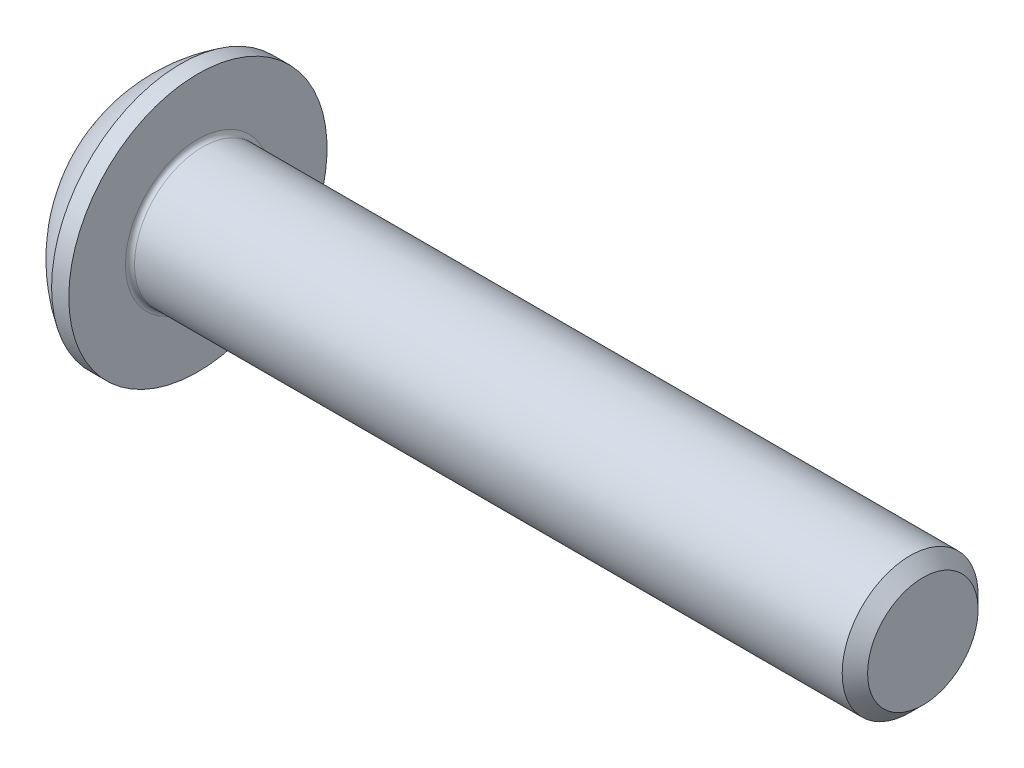
ISO-10303-21;
HEADER;
FILE_DESCRIPTION(('STEP AP214'),'2;1');
FILE_NAME('part.step','',(''),(''),'','','');
FILE_SCHEMA(('AUTOMOTIVE_DESIGN { 1 0 10303 214 1 1 1 1 }'));
ENDSEC;
DATA;
#1=APPLICATION_CONTEXT('core data for automotive mechanical design processes');
#2=APPLICATION_PROTOCOL_DEFINITION('international standard','automotive_design',2000,#1);
#3=PRODUCT_CONTEXT('',#1,'mechanical');
#4=PRODUCT('Part','Part','',(#3));
#5=PRODUCT_RELATED_PRODUCT_CATEGORY('part','',(#4));
#6=PRODUCT_DEFINITION_FORMATION('','',#4);
#7=PRODUCT_DEFINITION_CONTEXT('part definition',#1,'design');
#8=PRODUCT_DEFINITION('design','',#6,#7);
#9=PRODUCT_DEFINITION_SHAPE('','',#8);
#10=(LENGTH_UNIT() NAMED_UNIT(*) SI_UNIT(.MILLI.,.METRE.));
#11=(NAMED_UNIT(*) PLANE_ANGLE_UNIT() SI_UNIT($,.RADIAN.));
#12=(NAMED_UNIT(*) SI_UNIT($,.STERADIAN.) SOLID_ANGLE_UNIT());
#13=UNCERTAINTY_MEASURE_WITH_UNIT(LENGTH_MEASURE(1.E-05),#10,'distance_accuracy_value','');
#14=(GEOMETRIC_REPRESENTATION_CONTEXT(3) GLOBAL_UNCERTAINTY_ASSIGNED_CONTEXT((#13)) GLOBAL_UNIT_ASSIGNED_CONTEXT((#10,
#11,#12)) REPRESENTATION_CONTEXT('',''));
#15=CARTESIAN_POINT('',(0.,0.,0.));
#16=DIRECTION('',(0.,0.,1.));
#17=DIRECTION('',(1.,0.,0.));
#18=AXIS2_PLACEMENT_3D('',#15,#16,#17);
#19=CARTESIAN_POINT('',(0.,0.,0.));
#20=DIRECTION('',(-1.,0.,0.));
#21=DIRECTION('',(0.,0.,1.));
#22=AXIS2_PLACEMENT_3D('',#19,#20,#21);
#23=PLANE('',#22);
#24=CARTESIAN_POINT('',(0.,0.,0.));
#25=DIRECTION('',(-1.,0.,0.));
#26=DIRECTION('',(0.,0.,1.));
#27=AXIS2_PLACEMENT_3D('',#24,#25,#26);
#28=CIRCLE('',#27,1.425);
#29=CARTESIAN_POINT('',(0.,0.,1.425));
#30=VERTEX_POINT('',#29);
#31=EDGE_CURVE('E155',#30,#30,#28,.T.);
#32=ORIENTED_EDGE('',*,*,#31,.T.);
#33=EDGE_LOOP('',(#32));
#34=FACE_BOUND('',#33,.T.);
#35=DIRECTION('',(0.,-1.,0.));
#36=VECTOR('',#35,1.);
#37=CARTESIAN_POINT('',(0.,-0.577350269189625,0.999999999999998));
#38=LINE('',#37,#36);
#39=CARTESIAN_POINT('',(0.,0.577350269189628,1.));
#40=VERTEX_POINT('',#39);
#41=CARTESIAN_POINT('',(0.,-0.577350269189625,0.999999999999998));
#42=VERTEX_POINT('',#41);
#43=EDGE_CURVE('E50',#40,#42,#38,.T.);
#44=ORIENTED_EDGE('',*,*,#43,.T.);
#45=DIRECTION('',(0.,-0.499999999999999,-0.866025403784439));
#46=VECTOR('',#45,1.);
#47=CARTESIAN_POINT('',(0.,-1.15470053837925,0.));
#48=LINE('',#47,#46);
#49=CARTESIAN_POINT('',(0.,-1.15470053837925,0.));
#50=VERTEX_POINT('',#49);
#51=EDGE_CURVE('E275',#42,#50,#48,.T.);
#52=ORIENTED_EDGE('',*,*,#51,.T.);
#53=DIRECTION('',(0.,0.499999999999997,-0.86602540378444));
#54=VECTOR('',#53,1.);
#55=CARTESIAN_POINT('',(0.,-0.577350269189626,-1.));
#56=LINE('',#55,#54);
#57=CARTESIAN_POINT('',(0.,-0.577350269189626,-1.));
#58=VERTEX_POINT('',#57);
#59=EDGE_CURVE('E130',#50,#58,#56,.T.);
#60=ORIENTED_EDGE('',*,*,#59,.T.);
#61=DIRECTION('',(0.,1.,0.));
#62=VECTOR('',#61,1.);
#63=CARTESIAN_POINT('',(0.,0.577350269189628,-1.));
#64=LINE('',#63,#62);
#65=CARTESIAN_POINT('',(0.,0.577350269189628,-1.));
#66=VERTEX_POINT('',#65);
#67=EDGE_CURVE('E278',#58,#66,#64,.T.);
#68=ORIENTED_EDGE('',*,*,#67,.T.);
#69=DIRECTION('',(0.,0.499999999999998,0.866025403784439));
#70=VECTOR('',#69,1.);
#71=CARTESIAN_POINT('',(0.,1.15470053837925,0.));
#72=LINE('',#71,#70);
#73=CARTESIAN_POINT('',(0.,1.15470053837925,0.));
#74=VERTEX_POINT('',#73);
#75=EDGE_CURVE('E280',#66,#74,#72,.T.);
#76=ORIENTED_EDGE('',*,*,#75,.T.);
#77=DIRECTION('',(0.,-0.499999999999998,0.866025403784439));
#78=VECTOR('',#77,1.);
#79=CARTESIAN_POINT('',(0.,0.577350269189628,1.));
#80=LINE('',#79,#78);
#81=EDGE_CURVE('E282',#74,#40,#80,.T.);
#82=ORIENTED_EDGE('',*,*,#81,.T.);
#83=EDGE_LOOP('',(#44,#52,#60,#68,#76,#82));
#84=FACE_BOUND('',#83,.T.);
#85=ADVANCED_FACE('F35',(#34,#84),#23,.T.);
#86=CARTESIAN_POINT('',(3.03337598425198,0.,0.));
#87=DIRECTION('',(-1.,0.,0.));
#88=DIRECTION('',(0.,1.,0.));
#89=AXIS2_PLACEMENT_3D('',#86,#87,#88);
#90=SPHERICAL_SURFACE('',#89,3.35141684393879);
#91=CARTESIAN_POINT('',(1.27,0.,0.));
#92=DIRECTION('',(-1.,0.,0.));
#93=DIRECTION('',(0.,0.,1.));
#94=AXIS2_PLACEMENT_3D('',#91,#92,#93);
#95=CIRCLE('',#94,2.85);
#96=CARTESIAN_POINT('',(1.27,0.,2.85));
#97=VERTEX_POINT('',#96);
#98=EDGE_CURVE('E152',#97,#97,#95,.T.);
#99=ORIENTED_EDGE('',*,*,#98,.T.);
#100=EDGE_LOOP('',(#99));
#101=FACE_BOUND('',#100,.T.);
#102=ORIENTED_EDGE('',*,*,#31,.F.);
#103=EDGE_LOOP('',(#102));
#104=FACE_BOUND('',#103,.T.);
#105=ADVANCED_FACE('F176',(#101,#104),#90,.T.);
#106=CARTESIAN_POINT('',(0.,0.,0.));
#107=DIRECTION('',(-1.,0.,0.));
#108=DIRECTION('',(0.,0.,1.));
#109=AXIS2_PLACEMENT_3D('',#106,#107,#108);
#110=CYLINDRICAL_SURFACE('',#109,2.85);
#111=ORIENTED_EDGE('',*,*,#98,.F.);
#112=EDGE_LOOP('',(#111));
#113=FACE_BOUND('',#112,.T.);
#114=CARTESIAN_POINT('',(1.65,0.,0.));
#115=DIRECTION('',(-1.,0.,0.));
#116=DIRECTION('',(0.,0.,1.));
#117=AXIS2_PLACEMENT_3D('',#114,#115,#116);
#118=CIRCLE('',#117,2.85);
#119=CARTESIAN_POINT('',(1.65,0.,2.85));
#120=VERTEX_POINT('',#119);
#121=EDGE_CURVE('E149',#120,#120,#118,.T.);
#122=ORIENTED_EDGE('',*,*,#121,.T.);
#123=EDGE_LOOP('',(#122));
#124=FACE_BOUND('',#123,.T.);
#125=ADVANCED_FACE('F181',(#113,#124),#110,.T.);
#126=CARTESIAN_POINT('',(1.65,1.49999999999999,0.));
#127=DIRECTION('',(-1.,0.,0.));
#128=DIRECTION('',(0.,0.,1.));
#129=AXIS2_PLACEMENT_3D('',#126,#127,#128);
#130=PLANE('',#129);
#131=CARTESIAN_POINT('',(1.65,0.,0.));
#132=DIRECTION('',(-1.,0.,0.));
#133=DIRECTION('',(0.,0.,1.));
#134=AXIS2_PLACEMENT_3D('',#131,#132,#133);
#135=CIRCLE('',#134,1.6);
#136=CARTESIAN_POINT('',(1.65,0.,1.6));
#137=VERTEX_POINT('',#136);
#138=EDGE_CURVE('E43',#137,#137,#135,.T.);
#139=ORIENTED_EDGE('',*,*,#138,.T.);
#140=EDGE_LOOP('',(#139));
#141=FACE_BOUND('',#140,.T.);
#142=ORIENTED_EDGE('',*,*,#121,.F.);
#143=EDGE_LOOP('',(#142));
#144=FACE_BOUND('',#143,.T.);
#145=ADVANCED_FACE('F160',(#141,#144),#130,.F.);
#146=CARTESIAN_POINT('',(0.,0.,0.));
#147=DIRECTION('',(-1.,0.,0.));
#148=DIRECTION('',(0.,0.,1.));
#149=AXIS2_PLACEMENT_3D('',#146,#147,#148);
#150=CYLINDRICAL_SURFACE('',#149,1.5);
#151=CARTESIAN_POINT('',(1.75,0.,0.));
#152=DIRECTION('',(-1.,0.,0.));
#153=DIRECTION('',(0.,0.,1.));
#154=AXIS2_PLACEMENT_3D('',#151,#152,#153);
#155=CIRCLE('',#154,1.5);
#156=CARTESIAN_POINT('',(1.75,0.,1.5));
#157=VERTEX_POINT('',#156);
#158=EDGE_CURVE('E11',#157,#157,#155,.F.);
#159=ORIENTED_EDGE('',*,*,#158,.T.);
#160=EDGE_LOOP('',(#159));
#161=FACE_BOUND('',#160,.T.);
#162=CARTESIAN_POINT('',(17.3695,0.,0.));
#163=DIRECTION('',(-1.,0.,0.));
#164=DIRECTION('',(0.,0.,1.));
#165=AXIS2_PLACEMENT_3D('',#162,#163,#164);
#166=CIRCLE('',#165,1.5);
#167=CARTESIAN_POINT('',(17.3695,0.,1.5));
#168=VERTEX_POINT('',#167);
#169=EDGE_CURVE('E146',#168,#168,#166,.T.);
#170=ORIENTED_EDGE('',*,*,#169,.T.);
#171=EDGE_LOOP('',(#170));
#172=FACE_BOUND('',#171,.T.);
#173=ADVANCED_FACE('F190',(#161,#172),#150,.T.);
#174=CARTESIAN_POINT('',(17.65,0.,0.));
#175=DIRECTION('',(-1.,0.,0.));
#176=DIRECTION('',(0.,0.,1.));
#177=AXIS2_PLACEMENT_3D('',#174,#175,#176);
#178=CONICAL_SURFACE('',#177,1.2195,0.785398163397432);
#179=ORIENTED_EDGE('',*,*,#169,.F.);
#180=EDGE_LOOP('',(#179));
#181=FACE_BOUND('',#180,.T.);
#182=CARTESIAN_POINT('',(17.65,0.,0.));
#183=DIRECTION('',(-1.,0.,0.));
#184=DIRECTION('',(0.,0.,1.));
#185=AXIS2_PLACEMENT_3D('',#182,#183,#184);
#186=CIRCLE('',#185,1.2195);
#187=CARTESIAN_POINT('',(17.65,0.,1.2195));
#188=VERTEX_POINT('',#187);
#189=EDGE_CURVE('E142',#188,#188,#186,.T.);
#190=ORIENTED_EDGE('',*,*,#189,.T.);
#191=EDGE_LOOP('',(#190));
#192=FACE_BOUND('',#191,.T.);
#193=ADVANCED_FACE('F171',(#181,#192),#178,.T.);
#194=CARTESIAN_POINT('',(17.65,0.,0.));
#195=DIRECTION('',(-1.,0.,0.));
#196=DIRECTION('',(0.,0.,1.));
#197=AXIS2_PLACEMENT_3D('',#194,#195,#196);
#198=PLANE('',#197);
#199=ORIENTED_EDGE('',*,*,#189,.F.);
#200=EDGE_LOOP('',(#199));
#201=FACE_BOUND('',#200,.T.);
#202=ADVANCED_FACE('F164',(#201),#198,.F.);
#203=CARTESIAN_POINT('',(1.75,0.,0.));
#204=DIRECTION('',(-1.,0.,0.));
#205=DIRECTION('',(0.,0.,1.));
#206=AXIS2_PLACEMENT_3D('',#203,#204,#205);
#207=TOROIDAL_SURFACE('',#206,1.6,0.1);
#208=ORIENTED_EDGE('',*,*,#158,.F.);
#209=EDGE_LOOP('',(#208));
#210=FACE_BOUND('',#209,.T.);
#211=ORIENTED_EDGE('',*,*,#138,.F.);
#212=EDGE_LOOP('',(#211));
#213=FACE_BOUND('',#212,.T.);
#214=ADVANCED_FACE('F37',(#210,#213),#207,.F.);
#215=CARTESIAN_POINT('',(1.04,-1.15470053837925,0.));
#216=DIRECTION('',(0.,0.866025403784439,-0.499999999999999));
#217=DIRECTION('',(0.,0.499999999999999,0.866025403784439));
#218=AXIS2_PLACEMENT_3D('',#215,#216,#217);
#219=PLANE('',#218);
#220=DIRECTION('',(0.,-0.499999999999999,-0.866025403784439));
#221=VECTOR('',#220,1.);
#222=CARTESIAN_POINT('',(1.04,-1.15470053837925,0.));
#223=LINE('',#222,#221);
#224=CARTESIAN_POINT('',(1.04,-0.577350269189625,0.999999999999998));
#225=VERTEX_POINT('',#224);
#226=CARTESIAN_POINT('',(1.04,-0.866025403784437,0.499999999999998));
#227=VERTEX_POINT('',#226);
#228=EDGE_CURVE('E116',#225,#227,#223,.T.);
#229=ORIENTED_EDGE('',*,*,#228,.T.);
#230=CARTESIAN_POINT('',(1.04,-1.15470053837925,0.));
#231=VERTEX_POINT('',#230);
#232=EDGE_CURVE('E111',#227,#231,#223,.T.);
#233=ORIENTED_EDGE('',*,*,#232,.T.);
#234=DIRECTION('',(-1.,0.,0.));
#235=VECTOR('',#234,1.);
#236=CARTESIAN_POINT('',(1.04,-1.15470053837925,0.));
#237=LINE('',#236,#235);
#238=EDGE_CURVE('E113',#231,#50,#237,.T.);
#239=ORIENTED_EDGE('',*,*,#238,.T.);
#240=ORIENTED_EDGE('',*,*,#51,.F.);
#241=DIRECTION('',(-1.,0.,0.));
#242=VECTOR('',#241,1.);
#243=CARTESIAN_POINT('',(1.04,-0.577350269189625,0.999999999999998));
#244=LINE('',#243,#242);
#245=EDGE_CURVE('E271',#225,#42,#244,.T.);
#246=ORIENTED_EDGE('',*,*,#245,.F.);
#247=EDGE_LOOP('',(#229,#233,#239,#240,#246));
#248=FACE_BOUND('',#247,.T.);
#249=ADVANCED_FACE('F112',(#248),#219,.T.);
#250=CARTESIAN_POINT('',(1.04,-0.577350269189626,-1.));
#251=DIRECTION('',(0.,0.86602540378444,0.499999999999998));
#252=DIRECTION('',(0.,-0.499999999999998,0.86602540378444));
#253=AXIS2_PLACEMENT_3D('',#250,#251,#252);
#254=PLANE('',#253);
#255=DIRECTION('',(0.,0.499999999999997,-0.86602540378444));
#256=VECTOR('',#255,1.);
#257=CARTESIAN_POINT('',(1.04,-0.577350269189626,-1.));
#258=LINE('',#257,#256);
#259=CARTESIAN_POINT('',(1.04,-0.86602540378444,-0.499999999999997));
#260=VERTEX_POINT('',#259);
#261=EDGE_CURVE('E58',#231,#260,#258,.T.);
#262=ORIENTED_EDGE('',*,*,#261,.T.);
#263=CARTESIAN_POINT('',(1.04,-0.577350269189626,-1.));
#264=VERTEX_POINT('',#263);
#265=EDGE_CURVE('E125',#260,#264,#258,.T.);
#266=ORIENTED_EDGE('',*,*,#265,.T.);
#267=DIRECTION('',(-1.,0.,0.));
#268=VECTOR('',#267,1.);
#269=CARTESIAN_POINT('',(1.04,-0.577350269189626,-1.));
#270=LINE('',#269,#268);
#271=EDGE_CURVE('E132',#264,#58,#270,.T.);
#272=ORIENTED_EDGE('',*,*,#271,.T.);
#273=ORIENTED_EDGE('',*,*,#59,.F.);
#274=ORIENTED_EDGE('',*,*,#238,.F.);
#275=EDGE_LOOP('',(#262,#266,#272,#273,#274));
#276=FACE_BOUND('',#275,.T.);
#277=ADVANCED_FACE('F128',(#276),#254,.T.);
#278=CARTESIAN_POINT('',(1.04,0.577350269189628,-1.));
#279=DIRECTION('',(0.,0.,1.));
#280=DIRECTION('',(0.,-1.,0.));
#281=AXIS2_PLACEMENT_3D('',#278,#279,#280);
#282=PLANE('',#281);
#283=DIRECTION('',(0.,1.,0.));
#284=VECTOR('',#283,1.);
#285=CARTESIAN_POINT('',(1.04,0.577350269189628,-1.));
#286=LINE('',#285,#284);
#287=CARTESIAN_POINT('',(1.04,0.,-1.));
#288=VERTEX_POINT('',#287);
#289=EDGE_CURVE('E252',#264,#288,#286,.T.);
#290=ORIENTED_EDGE('',*,*,#289,.T.);
#291=CARTESIAN_POINT('',(1.04,0.577350269189628,-1.));
#292=VERTEX_POINT('',#291);
#293=EDGE_CURVE('E124',#288,#292,#286,.T.);
#294=ORIENTED_EDGE('',*,*,#293,.T.);
#295=DIRECTION('',(-1.,0.,0.));
#296=VECTOR('',#295,1.);
#297=CARTESIAN_POINT('',(1.04,0.577350269189628,-1.));
#298=LINE('',#297,#296);
#299=EDGE_CURVE('E137',#292,#66,#298,.T.);
#300=ORIENTED_EDGE('',*,*,#299,.T.);
#301=ORIENTED_EDGE('',*,*,#67,.F.);
#302=ORIENTED_EDGE('',*,*,#271,.F.);
#303=EDGE_LOOP('',(#290,#294,#300,#301,#302));
#304=FACE_BOUND('',#303,.T.);
#305=ADVANCED_FACE('F204',(#304),#282,.T.);
#306=CARTESIAN_POINT('',(1.04,1.15470053837925,0.));
#307=DIRECTION('',(0.,-0.86602540378444,0.499999999999998));
#308=DIRECTION('',(0.,-0.499999999999998,-0.86602540378444));
#309=AXIS2_PLACEMENT_3D('',#306,#307,#308);
#310=PLANE('',#309);
#311=DIRECTION('',(0.,0.499999999999998,0.866025403784439));
#312=VECTOR('',#311,1.);
#313=CARTESIAN_POINT('',(1.04,1.15470053837925,0.));
#314=LINE('',#313,#312);
#315=CARTESIAN_POINT('',(1.04,0.86602540378444,-0.499999999999999));
#316=VERTEX_POINT('',#315);
#317=EDGE_CURVE('E241',#292,#316,#314,.T.);
#318=ORIENTED_EDGE('',*,*,#317,.T.);
#319=CARTESIAN_POINT('',(1.04,1.15470053837925,0.));
#320=VERTEX_POINT('',#319);
#321=EDGE_CURVE('E246',#316,#320,#314,.T.);
#322=ORIENTED_EDGE('',*,*,#321,.T.);
#323=DIRECTION('',(-1.,0.,0.));
#324=VECTOR('',#323,1.);
#325=CARTESIAN_POINT('',(1.04,1.15470053837925,0.));
#326=LINE('',#325,#324);
#327=EDGE_CURVE('E286',#320,#74,#326,.T.);
#328=ORIENTED_EDGE('',*,*,#327,.T.);
#329=ORIENTED_EDGE('',*,*,#75,.F.);
#330=ORIENTED_EDGE('',*,*,#299,.F.);
#331=EDGE_LOOP('',(#318,#322,#328,#329,#330));
#332=FACE_BOUND('',#331,.T.);
#333=ADVANCED_FACE('F207',(#332),#310,.T.);
#334=CARTESIAN_POINT('',(1.04,0.577350269189628,1.));
#335=DIRECTION('',(0.,-0.86602540378444,-0.499999999999998));
#336=DIRECTION('',(0.,0.499999999999998,-0.86602540378444));
#337=AXIS2_PLACEMENT_3D('',#334,#335,#336);
#338=PLANE('',#337);
#339=DIRECTION('',(0.,-0.499999999999998,0.866025403784439));
#340=VECTOR('',#339,1.);
#341=CARTESIAN_POINT('',(1.04,0.577350269189628,1.));
#342=LINE('',#341,#340);
#343=CARTESIAN_POINT('',(1.04,0.86602540378444,0.499999999999999));
#344=VERTEX_POINT('',#343);
#345=EDGE_CURVE('E249',#320,#344,#342,.T.);
#346=ORIENTED_EDGE('',*,*,#345,.T.);
#347=CARTESIAN_POINT('',(1.04,0.577350269189628,1.));
#348=VERTEX_POINT('',#347);
#349=EDGE_CURVE('E257',#344,#348,#342,.T.);
#350=ORIENTED_EDGE('',*,*,#349,.T.);
#351=DIRECTION('',(-1.,0.,0.));
#352=VECTOR('',#351,1.);
#353=CARTESIAN_POINT('',(1.04,0.577350269189628,1.));
#354=LINE('',#353,#352);
#355=EDGE_CURVE('E270',#348,#40,#354,.T.);
#356=ORIENTED_EDGE('',*,*,#355,.T.);
#357=ORIENTED_EDGE('',*,*,#81,.F.);
#358=ORIENTED_EDGE('',*,*,#327,.F.);
#359=EDGE_LOOP('',(#346,#350,#356,#357,#358));
#360=FACE_BOUND('',#359,.T.);
#361=ADVANCED_FACE('F211',(#360),#338,.T.);
#362=CARTESIAN_POINT('',(1.04,-0.577350269189625,0.999999999999998));
#363=DIRECTION('',(0.,0.,-1.));
#364=DIRECTION('',(0.,1.,0.));
#365=AXIS2_PLACEMENT_3D('',#362,#363,#364);
#366=PLANE('',#365);
#367=DIRECTION('',(0.,-1.,0.));
#368=VECTOR('',#367,1.);
#369=CARTESIAN_POINT('',(1.04,-0.577350269189625,0.999999999999998));
#370=LINE('',#369,#368);
#371=CARTESIAN_POINT('',(1.04,0.,1.));
#372=VERTEX_POINT('',#371);
#373=EDGE_CURVE('E263',#348,#372,#370,.T.);
#374=ORIENTED_EDGE('',*,*,#373,.T.);
#375=EDGE_CURVE('E265',#372,#225,#370,.T.);
#376=ORIENTED_EDGE('',*,*,#375,.T.);
#377=ORIENTED_EDGE('',*,*,#245,.T.);
#378=ORIENTED_EDGE('',*,*,#43,.F.);
#379=ORIENTED_EDGE('',*,*,#355,.F.);
#380=EDGE_LOOP('',(#374,#376,#377,#378,#379));
#381=FACE_BOUND('',#380,.T.);
#382=ADVANCED_FACE('F215',(#381),#366,.T.);
#383=CARTESIAN_POINT('',(1.04,-1.73205080756887,-0.999999999999999));
#384=DIRECTION('',(1.,0.,0.));
#385=DIRECTION('',(0.,0.,-1.));
#386=AXIS2_PLACEMENT_3D('',#383,#384,#385);
#387=PLANE('',#386);
#388=CARTESIAN_POINT('',(1.04,0.,0.));
#389=DIRECTION('',(-1.,0.,0.));
#390=DIRECTION('',(0.,0.,1.));
#391=AXIS2_PLACEMENT_3D('',#388,#389,#390);
#392=CIRCLE('',#391,1.);
#393=EDGE_CURVE('E238',#316,#288,#392,.T.);
#394=ORIENTED_EDGE('',*,*,#393,.F.);
#395=ORIENTED_EDGE('',*,*,#317,.F.);
#396=ORIENTED_EDGE('',*,*,#293,.F.);
#397=EDGE_LOOP('',(#394,#395,#396));
#398=FACE_BOUND('',#397,.T.);
#399=ADVANCED_FACE('F219',(#398),#387,.F.);
#400=EDGE_CURVE('E143',#344,#316,#392,.T.);
#401=ORIENTED_EDGE('',*,*,#400,.F.);
#402=ORIENTED_EDGE('',*,*,#345,.F.);
#403=ORIENTED_EDGE('',*,*,#321,.F.);
#404=EDGE_LOOP('',(#401,#402,#403));
#405=FACE_BOUND('',#404,.T.);
#406=ADVANCED_FACE('F228',(#405),#387,.F.);
#407=EDGE_CURVE('E136',#372,#344,#392,.T.);
#408=ORIENTED_EDGE('',*,*,#407,.F.);
#409=ORIENTED_EDGE('',*,*,#373,.F.);
#410=ORIENTED_EDGE('',*,*,#349,.F.);
#411=EDGE_LOOP('',(#408,#409,#410));
#412=FACE_BOUND('',#411,.T.);
#413=ADVANCED_FACE('F233',(#412),#387,.F.);
#414=EDGE_CURVE('E131',#227,#372,#392,.T.);
#415=ORIENTED_EDGE('',*,*,#414,.F.);
#416=ORIENTED_EDGE('',*,*,#228,.F.);
#417=ORIENTED_EDGE('',*,*,#375,.F.);
#418=EDGE_LOOP('',(#415,#416,#417));
#419=FACE_BOUND('',#418,.T.);
#420=ADVANCED_FACE('F226',(#419),#387,.F.);
#421=EDGE_CURVE('E122',#260,#227,#392,.T.);
#422=ORIENTED_EDGE('',*,*,#421,.F.);
#423=ORIENTED_EDGE('',*,*,#261,.F.);
#424=ORIENTED_EDGE('',*,*,#232,.F.);
#425=EDGE_LOOP('',(#422,#423,#424));
#426=FACE_BOUND('',#425,.T.);
#427=ADVANCED_FACE('F121',(#426),#387,.F.);
#428=EDGE_CURVE('E244',#288,#260,#392,.T.);
#429=ORIENTED_EDGE('',*,*,#428,.F.);
#430=ORIENTED_EDGE('',*,*,#289,.F.);
#431=ORIENTED_EDGE('',*,*,#265,.F.);
#432=EDGE_LOOP('',(#429,#430,#431));
#433=FACE_BOUND('',#432,.T.);
#434=ADVANCED_FACE('F199',(#433),#387,.F.);
#435=CARTESIAN_POINT('',(1.61735026918963,0.,0.));
#436=DIRECTION('',(-1.,0.,0.));
#437=DIRECTION('',(0.,0.,1.));
#438=AXIS2_PLACEMENT_3D('',#435,#436,#437);
#439=CONICAL_SURFACE('',#438,0.,1.04719755119659);
#440=ORIENTED_EDGE('',*,*,#407,.T.);
#441=ORIENTED_EDGE('',*,*,#400,.T.);
#442=ORIENTED_EDGE('',*,*,#393,.T.);
#443=ORIENTED_EDGE('',*,*,#428,.T.);
#444=ORIENTED_EDGE('',*,*,#421,.T.);
#445=ORIENTED_EDGE('',*,*,#414,.T.);
#446=EDGE_LOOP('',(#440,#441,#442,#443,#444,#445));
#447=FACE_BOUND('',#446,.T.);
#448=CARTESIAN_POINT('',(1.61735026918963,0.,0.));
#449=VERTEX_POINT('',#448);
#450=VERTEX_LOOP('',#449);
#451=FACE_BOUND('',#450,.T.);
#452=ADVANCED_FACE('F197',(#447,#451),#439,.F.);
#453=CLOSED_SHELL('',(#85,#105,#125,#145,#173,#193,#202,#214,#249,#277,#305,#333,#361,#382,#399,
#406,#413,#420,#427,#434,#452));
#454=MANIFOLD_SOLID_BREP('B2',#453);
#455=ADVANCED_BREP_SHAPE_REPRESENTATION('',(#18,#454),#14);
#456=SHAPE_DEFINITION_REPRESENTATION(#9,#455);
ENDSEC;
END-ISO-10303-21;
